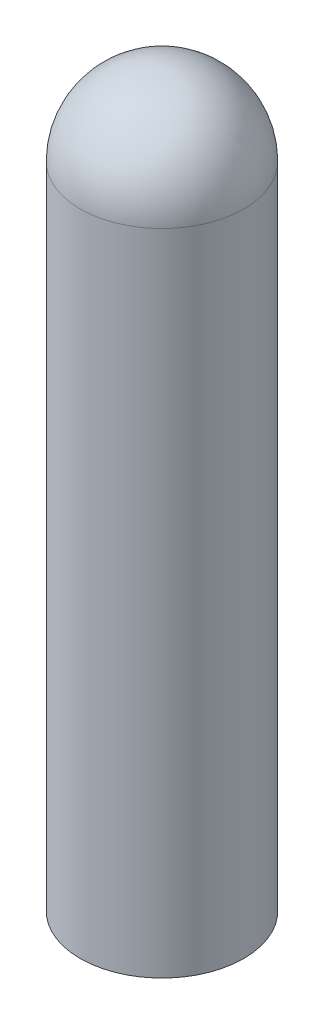
ISO-10303-21;
HEADER;
FILE_DESCRIPTION(('STEP AP214'),'2;1');
FILE_NAME('part.step','',(''),(''),'','','');
FILE_SCHEMA(('AUTOMOTIVE_DESIGN { 1 0 10303 214 1 1 1 1 }'));
ENDSEC;
DATA;
#1=APPLICATION_CONTEXT('core data for automotive mechanical design processes');
#2=APPLICATION_PROTOCOL_DEFINITION('international standard','automotive_design',2000,#1);
#3=PRODUCT_CONTEXT('',#1,'mechanical');
#4=PRODUCT('Part','Part','',(#3));
#5=PRODUCT_RELATED_PRODUCT_CATEGORY('part','',(#4));
#6=PRODUCT_DEFINITION_FORMATION('','',#4);
#7=PRODUCT_DEFINITION_CONTEXT('part definition',#1,'design');
#8=PRODUCT_DEFINITION('design','',#6,#7);
#9=PRODUCT_DEFINITION_SHAPE('','',#8);
#10=(LENGTH_UNIT() NAMED_UNIT(*) SI_UNIT(.MILLI.,.METRE.));
#11=(NAMED_UNIT(*) PLANE_ANGLE_UNIT() SI_UNIT($,.RADIAN.));
#12=(NAMED_UNIT(*) SI_UNIT($,.STERADIAN.) SOLID_ANGLE_UNIT());
#13=UNCERTAINTY_MEASURE_WITH_UNIT(LENGTH_MEASURE(1.E-05),#10,'distance_accuracy_value','');
#14=(GEOMETRIC_REPRESENTATION_CONTEXT(3) GLOBAL_UNCERTAINTY_ASSIGNED_CONTEXT((#13)) GLOBAL_UNIT_ASSIGNED_CONTEXT((#10,
#11,#12)) REPRESENTATION_CONTEXT('',''));
#15=CARTESIAN_POINT('',(0.,0.,0.));
#16=DIRECTION('',(0.,0.,1.));
#17=DIRECTION('',(1.,0.,0.));
#18=AXIS2_PLACEMENT_3D('',#15,#16,#17);
#19=CARTESIAN_POINT('',(-3.556,0.,0.));
#20=DIRECTION('',(0.,-1.,0.));
#21=DIRECTION('',(0.,0.,-1.));
#22=AXIS2_PLACEMENT_3D('',#19,#20,#21);
#23=PLANE('',#22);
#24=CARTESIAN_POINT('',(0.,0.,0.));
#25=DIRECTION('',(0.,-1.,0.));
#26=DIRECTION('',(0.,0.,-1.));
#27=AXIS2_PLACEMENT_3D('',#24,#25,#26);
#28=CIRCLE('',#27,3.175);
#29=CARTESIAN_POINT('',(0.,0.,-3.175));
#30=VERTEX_POINT('',#29);
#31=EDGE_CURVE('E43',#30,#30,#28,.T.);
#32=ORIENTED_EDGE('',*,*,#31,.F.);
#33=EDGE_LOOP('',(#32));
#34=FACE_BOUND('',#33,.T.);
#35=CARTESIAN_POINT('',(0.,0.,0.));
#36=DIRECTION('',(0.,1.,0.));
#37=DIRECTION('',(0.,0.,1.));
#38=AXIS2_PLACEMENT_3D('',#35,#36,#37);
#39=CIRCLE('',#38,3.556);
#40=CARTESIAN_POINT('',(0.,0.,3.556));
#41=VERTEX_POINT('',#40);
#42=EDGE_CURVE('E10',#41,#41,#39,.T.);
#43=ORIENTED_EDGE('',*,*,#42,.F.);
#44=EDGE_LOOP('',(#43));
#45=FACE_BOUND('',#44,.T.);
#46=ADVANCED_FACE('F29',(#34,#45),#23,.T.);
#47=CARTESIAN_POINT('',(0.,0.,0.));
#48=DIRECTION('',(0.,1.,0.));
#49=DIRECTION('',(0.,0.,1.));
#50=AXIS2_PLACEMENT_3D('',#47,#48,#49);
#51=CYLINDRICAL_SURFACE('',#50,3.556);
#52=ORIENTED_EDGE('',*,*,#42,.T.);
#53=EDGE_LOOP('',(#52));
#54=FACE_BOUND('',#53,.T.);
#55=CARTESIAN_POINT('',(0.,28.194,0.));
#56=DIRECTION('',(0.,1.,0.));
#57=DIRECTION('',(0.,0.,1.));
#58=AXIS2_PLACEMENT_3D('',#55,#56,#57);
#59=CIRCLE('',#58,3.556);
#60=CARTESIAN_POINT('',(0.,28.194,3.556));
#61=VERTEX_POINT('',#60);
#62=EDGE_CURVE('E35',#61,#61,#59,.T.);
#63=ORIENTED_EDGE('',*,*,#62,.F.);
#64=EDGE_LOOP('',(#63));
#65=FACE_BOUND('',#64,.T.);
#66=ADVANCED_FACE('F53',(#54,#65),#51,.T.);
#67=CARTESIAN_POINT('',(0.,28.194,0.));
#68=DIRECTION('',(0.,1.,0.));
#69=DIRECTION('',(-1.,0.,0.));
#70=AXIS2_PLACEMENT_3D('',#67,#68,#69);
#71=SPHERICAL_SURFACE('',#70,3.556);
#72=ORIENTED_EDGE('',*,*,#62,.T.);
#73=EDGE_LOOP('',(#72));
#74=FACE_BOUND('',#73,.T.);
#75=ADVANCED_FACE('F57',(#74),#71,.T.);
#76=CARTESIAN_POINT('',(0.,28.575,0.));
#77=DIRECTION('',(0.,-1.,0.));
#78=DIRECTION('',(0.,0.,-1.));
#79=AXIS2_PLACEMENT_3D('',#76,#77,#78);
#80=CYLINDRICAL_SURFACE('',#79,3.175);
#81=CARTESIAN_POINT('',(0.,28.575,0.));
#82=DIRECTION('',(0.,-1.,0.));
#83=DIRECTION('',(0.,0.,-1.));
#84=AXIS2_PLACEMENT_3D('',#81,#82,#83);
#85=CIRCLE('',#84,3.175);
#86=CARTESIAN_POINT('',(0.,28.575,-3.175));
#87=VERTEX_POINT('',#86);
#88=EDGE_CURVE('E39',#87,#87,#85,.T.);
#89=ORIENTED_EDGE('',*,*,#88,.F.);
#90=EDGE_LOOP('',(#89));
#91=FACE_BOUND('',#90,.T.);
#92=ORIENTED_EDGE('',*,*,#31,.T.);
#93=EDGE_LOOP('',(#92));
#94=FACE_BOUND('',#93,.T.);
#95=ADVANCED_FACE('F49',(#91,#94),#80,.F.);
#96=CARTESIAN_POINT('',(0.,28.575,0.));
#97=DIRECTION('',(0.,-1.,0.));
#98=DIRECTION('',(0.,0.,-1.));
#99=AXIS2_PLACEMENT_3D('',#96,#97,#98);
#100=PLANE('',#99);
#101=ORIENTED_EDGE('',*,*,#88,.T.);
#102=EDGE_LOOP('',(#101));
#103=FACE_BOUND('',#102,.T.);
#104=ADVANCED_FACE('F66',(#103),#100,.T.);
#105=CLOSED_SHELL('',(#46,#66,#75,#95,#104));
#106=MANIFOLD_SOLID_BREP('B2',#105);
#107=ADVANCED_BREP_SHAPE_REPRESENTATION('',(#18,#106),#14);
#108=SHAPE_DEFINITION_REPRESENTATION(#9,#107);
ENDSEC;
END-ISO-10303-21;
